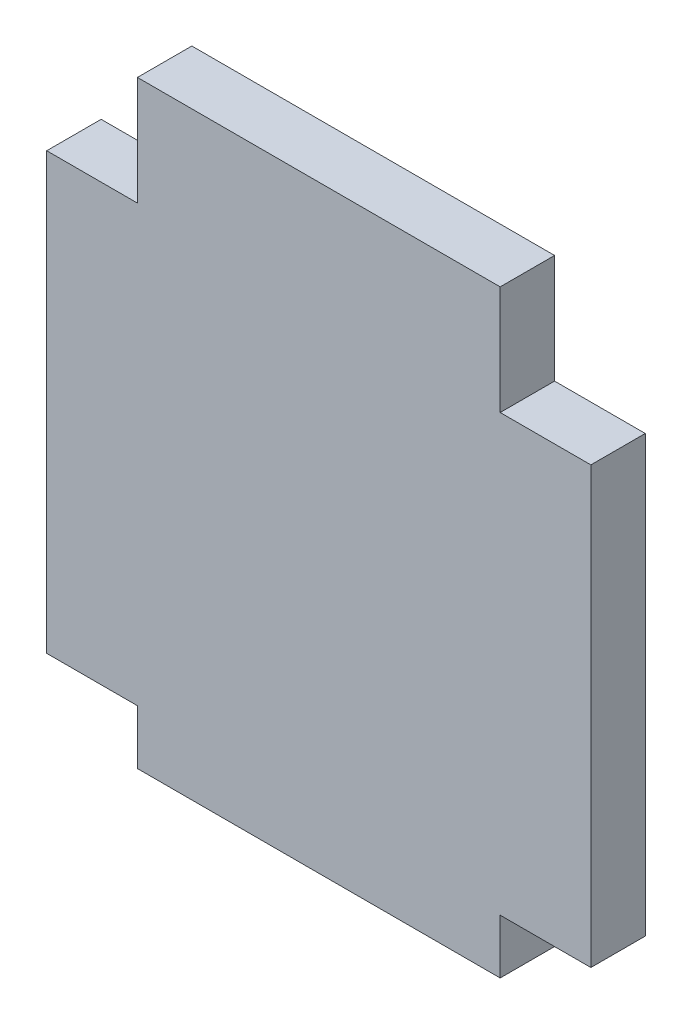
ISO-10303-21;
HEADER;
FILE_DESCRIPTION(('STEP AP214'),'2;1');
FILE_NAME('part.step','',(''),(''),'','','');
FILE_SCHEMA(('AUTOMOTIVE_DESIGN { 1 0 10303 214 1 1 1 1 }'));
ENDSEC;
DATA;
#1=APPLICATION_CONTEXT('core data for automotive mechanical design processes');
#2=APPLICATION_PROTOCOL_DEFINITION('international standard','automotive_design',2000,#1);
#3=PRODUCT_CONTEXT('',#1,'mechanical');
#4=PRODUCT('Part','Part','',(#3));
#5=PRODUCT_RELATED_PRODUCT_CATEGORY('part','',(#4));
#6=PRODUCT_DEFINITION_FORMATION('','',#4);
#7=PRODUCT_DEFINITION_CONTEXT('part definition',#1,'design');
#8=PRODUCT_DEFINITION('design','',#6,#7);
#9=PRODUCT_DEFINITION_SHAPE('','',#8);
#10=(LENGTH_UNIT() NAMED_UNIT(*) SI_UNIT(.MILLI.,.METRE.));
#11=(NAMED_UNIT(*) PLANE_ANGLE_UNIT() SI_UNIT($,.RADIAN.));
#12=(NAMED_UNIT(*) SI_UNIT($,.STERADIAN.) SOLID_ANGLE_UNIT());
#13=UNCERTAINTY_MEASURE_WITH_UNIT(LENGTH_MEASURE(1.E-05),#10,'distance_accuracy_value','');
#14=(GEOMETRIC_REPRESENTATION_CONTEXT(3) GLOBAL_UNCERTAINTY_ASSIGNED_CONTEXT((#13)) GLOBAL_UNIT_ASSIGNED_CONTEXT((#10,
#11,#12)) REPRESENTATION_CONTEXT('',''));
#15=CARTESIAN_POINT('',(0.,0.,0.));
#16=DIRECTION('',(0.,0.,1.));
#17=DIRECTION('',(1.,0.,0.));
#18=AXIS2_PLACEMENT_3D('',#15,#16,#17);
#19=CARTESIAN_POINT('',(0.,-12.,3.));
#20=DIRECTION('',(0.,1.,0.));
#21=DIRECTION('',(0.,0.,1.));
#22=AXIS2_PLACEMENT_3D('',#19,#20,#21);
#23=PLANE('',#22);
#24=DIRECTION('',(1.,0.,0.));
#25=VECTOR('',#24,1.);
#26=CARTESIAN_POINT('',(0.,-12.,0.));
#27=LINE('',#26,#25);
#28=CARTESIAN_POINT('',(-15.,-12.,0.));
#29=VERTEX_POINT('',#28);
#30=CARTESIAN_POINT('',(-10.,-12.,0.));
#31=VERTEX_POINT('',#30);
#32=EDGE_CURVE('E185',#29,#31,#27,.T.);
#33=ORIENTED_EDGE('',*,*,#32,.T.);
#34=DIRECTION('',(0.,0.,-1.));
#35=VECTOR('',#34,1.);
#36=CARTESIAN_POINT('',(-10.,-12.,3.));
#37=LINE('',#36,#35);
#38=CARTESIAN_POINT('',(-10.,-12.,3.));
#39=VERTEX_POINT('',#38);
#40=EDGE_CURVE('E12',#39,#31,#37,.T.);
#41=ORIENTED_EDGE('',*,*,#40,.F.);
#42=DIRECTION('',(1.,0.,0.));
#43=VECTOR('',#42,1.);
#44=CARTESIAN_POINT('',(0.,-12.,3.));
#45=LINE('',#44,#43);
#46=CARTESIAN_POINT('',(-15.,-12.,3.));
#47=VERTEX_POINT('',#46);
#48=EDGE_CURVE('E101',#47,#39,#45,.T.);
#49=ORIENTED_EDGE('',*,*,#48,.F.);
#50=DIRECTION('',(0.,0.,-1.));
#51=VECTOR('',#50,1.);
#52=CARTESIAN_POINT('',(-15.,-12.,3.));
#53=LINE('',#52,#51);
#54=EDGE_CURVE('E52',#47,#29,#53,.T.);
#55=ORIENTED_EDGE('',*,*,#54,.T.);
#56=EDGE_LOOP('',(#33,#41,#49,#55));
#57=FACE_BOUND('',#56,.T.);
#58=ADVANCED_FACE('F35',(#57),#23,.F.);
#59=CARTESIAN_POINT('',(-10.,0.,3.));
#60=DIRECTION('',(-1.,0.,0.));
#61=DIRECTION('',(0.,-1.,0.));
#62=AXIS2_PLACEMENT_3D('',#59,#60,#61);
#63=PLANE('',#62);
#64=DIRECTION('',(0.,1.,0.));
#65=VECTOR('',#64,1.);
#66=CARTESIAN_POINT('',(-10.,0.,0.));
#67=LINE('',#66,#65);
#68=CARTESIAN_POINT('',(-10.,-15.,0.));
#69=VERTEX_POINT('',#68);
#70=EDGE_CURVE('E187',#69,#31,#67,.T.);
#71=ORIENTED_EDGE('',*,*,#70,.F.);
#72=DIRECTION('',(0.,0.,-1.));
#73=VECTOR('',#72,1.);
#74=CARTESIAN_POINT('',(-10.,-15.,3.));
#75=LINE('',#74,#73);
#76=CARTESIAN_POINT('',(-10.,-15.,3.));
#77=VERTEX_POINT('',#76);
#78=EDGE_CURVE('E44',#77,#69,#75,.T.);
#79=ORIENTED_EDGE('',*,*,#78,.F.);
#80=DIRECTION('',(0.,1.,0.));
#81=VECTOR('',#80,1.);
#82=CARTESIAN_POINT('',(-10.,0.,3.));
#83=LINE('',#82,#81);
#84=EDGE_CURVE('E250',#77,#39,#83,.T.);
#85=ORIENTED_EDGE('',*,*,#84,.T.);
#86=ORIENTED_EDGE('',*,*,#40,.T.);
#87=EDGE_LOOP('',(#71,#79,#85,#86));
#88=FACE_BOUND('',#87,.T.);
#89=ADVANCED_FACE('F37',(#88),#63,.T.);
#90=CARTESIAN_POINT('',(0.,-15.,3.));
#91=DIRECTION('',(0.,-1.,0.));
#92=DIRECTION('',(1.,0.,0.));
#93=AXIS2_PLACEMENT_3D('',#90,#91,#92);
#94=PLANE('',#93);
#95=DIRECTION('',(-1.,0.,0.));
#96=VECTOR('',#95,1.);
#97=CARTESIAN_POINT('',(0.,-15.,0.));
#98=LINE('',#97,#96);
#99=CARTESIAN_POINT('',(9.99999999999999,-15.,0.));
#100=VERTEX_POINT('',#99);
#101=EDGE_CURVE('E191',#100,#69,#98,.T.);
#102=ORIENTED_EDGE('',*,*,#101,.F.);
#103=DIRECTION('',(0.,0.,-1.));
#104=VECTOR('',#103,1.);
#105=CARTESIAN_POINT('',(9.99999999999999,-15.,3.));
#106=LINE('',#105,#104);
#107=CARTESIAN_POINT('',(9.99999999999999,-15.,3.));
#108=VERTEX_POINT('',#107);
#109=EDGE_CURVE('E227',#108,#100,#106,.T.);
#110=ORIENTED_EDGE('',*,*,#109,.F.);
#111=DIRECTION('',(-1.,0.,0.));
#112=VECTOR('',#111,1.);
#113=CARTESIAN_POINT('',(0.,-15.,3.));
#114=LINE('',#113,#112);
#115=EDGE_CURVE('E234',#108,#77,#114,.T.);
#116=ORIENTED_EDGE('',*,*,#115,.T.);
#117=ORIENTED_EDGE('',*,*,#78,.T.);
#118=EDGE_LOOP('',(#102,#110,#116,#117));
#119=FACE_BOUND('',#118,.T.);
#120=ADVANCED_FACE('F232',(#119),#94,.T.);
#121=CARTESIAN_POINT('',(9.99999999999998,0.,3.));
#122=DIRECTION('',(-1.,0.,0.));
#123=DIRECTION('',(0.,-1.,0.));
#124=AXIS2_PLACEMENT_3D('',#121,#122,#123);
#125=PLANE('',#124);
#126=DIRECTION('',(0.,1.,0.));
#127=VECTOR('',#126,1.);
#128=CARTESIAN_POINT('',(9.99999999999998,0.,0.));
#129=LINE('',#128,#127);
#130=CARTESIAN_POINT('',(9.99999999999999,-12.,0.));
#131=VERTEX_POINT('',#130);
#132=EDGE_CURVE('E194',#100,#131,#129,.T.);
#133=ORIENTED_EDGE('',*,*,#132,.T.);
#134=DIRECTION('',(0.,0.,-1.));
#135=VECTOR('',#134,1.);
#136=CARTESIAN_POINT('',(9.99999999999999,-12.,3.));
#137=LINE('',#136,#135);
#138=CARTESIAN_POINT('',(9.99999999999999,-12.,3.));
#139=VERTEX_POINT('',#138);
#140=EDGE_CURVE('E224',#139,#131,#137,.T.);
#141=ORIENTED_EDGE('',*,*,#140,.F.);
#142=DIRECTION('',(0.,1.,0.));
#143=VECTOR('',#142,1.);
#144=CARTESIAN_POINT('',(9.99999999999998,0.,3.));
#145=LINE('',#144,#143);
#146=EDGE_CURVE('E166',#108,#139,#145,.T.);
#147=ORIENTED_EDGE('',*,*,#146,.F.);
#148=ORIENTED_EDGE('',*,*,#109,.T.);
#149=EDGE_LOOP('',(#133,#141,#147,#148));
#150=FACE_BOUND('',#149,.T.);
#151=ADVANCED_FACE('F244',(#150),#125,.F.);
#152=CARTESIAN_POINT('',(15.,-12.,0.));
#153=VERTEX_POINT('',#152);
#154=EDGE_CURVE('E188',#131,#153,#27,.T.);
#155=ORIENTED_EDGE('',*,*,#154,.T.);
#156=DIRECTION('',(0.,0.,-1.));
#157=VECTOR('',#156,1.);
#158=CARTESIAN_POINT('',(15.,-12.,3.));
#159=LINE('',#158,#157);
#160=CARTESIAN_POINT('',(15.,-12.,3.));
#161=VERTEX_POINT('',#160);
#162=EDGE_CURVE('E221',#161,#153,#159,.T.);
#163=ORIENTED_EDGE('',*,*,#162,.F.);
#164=EDGE_CURVE('E163',#139,#161,#45,.T.);
#165=ORIENTED_EDGE('',*,*,#164,.F.);
#166=ORIENTED_EDGE('',*,*,#140,.T.);
#167=EDGE_LOOP('',(#155,#163,#165,#166));
#168=FACE_BOUND('',#167,.T.);
#169=ADVANCED_FACE('F248',(#168),#23,.F.);
#170=CARTESIAN_POINT('',(15.,0.,3.));
#171=DIRECTION('',(-1.,0.,0.));
#172=DIRECTION('',(0.,0.,1.));
#173=AXIS2_PLACEMENT_3D('',#170,#171,#172);
#174=PLANE('',#173);
#175=DIRECTION('',(0.,1.,0.));
#176=VECTOR('',#175,1.);
#177=CARTESIAN_POINT('',(15.,0.,0.));
#178=LINE('',#177,#176);
#179=CARTESIAN_POINT('',(15.,12.,0.));
#180=VERTEX_POINT('',#179);
#181=EDGE_CURVE('E196',#153,#180,#178,.T.);
#182=ORIENTED_EDGE('',*,*,#181,.T.);
#183=DIRECTION('',(0.,0.,-1.));
#184=VECTOR('',#183,1.);
#185=CARTESIAN_POINT('',(15.,12.,3.));
#186=LINE('',#185,#184);
#187=CARTESIAN_POINT('',(15.,12.,3.));
#188=VERTEX_POINT('',#187);
#189=EDGE_CURVE('E219',#188,#180,#186,.T.);
#190=ORIENTED_EDGE('',*,*,#189,.F.);
#191=DIRECTION('',(0.,1.,0.));
#192=VECTOR('',#191,1.);
#193=CARTESIAN_POINT('',(15.,0.,3.));
#194=LINE('',#193,#192);
#195=EDGE_CURVE('E159',#161,#188,#194,.T.);
#196=ORIENTED_EDGE('',*,*,#195,.F.);
#197=ORIENTED_EDGE('',*,*,#162,.T.);
#198=EDGE_LOOP('',(#182,#190,#196,#197));
#199=FACE_BOUND('',#198,.T.);
#200=ADVANCED_FACE('F260',(#199),#174,.F.);
#201=CARTESIAN_POINT('',(0.,12.,3.));
#202=DIRECTION('',(0.,1.,0.));
#203=DIRECTION('',(0.,0.,1.));
#204=AXIS2_PLACEMENT_3D('',#201,#202,#203);
#205=PLANE('',#204);
#206=DIRECTION('',(1.,0.,0.));
#207=VECTOR('',#206,1.);
#208=CARTESIAN_POINT('',(0.,12.,0.));
#209=LINE('',#208,#207);
#210=CARTESIAN_POINT('',(9.99999999999999,12.,0.));
#211=VERTEX_POINT('',#210);
#212=EDGE_CURVE('E199',#211,#180,#209,.T.);
#213=ORIENTED_EDGE('',*,*,#212,.F.);
#214=DIRECTION('',(0.,0.,-1.));
#215=VECTOR('',#214,1.);
#216=CARTESIAN_POINT('',(9.99999999999999,12.,3.));
#217=LINE('',#216,#215);
#218=CARTESIAN_POINT('',(9.99999999999999,12.,3.));
#219=VERTEX_POINT('',#218);
#220=EDGE_CURVE('E217',#219,#211,#217,.T.);
#221=ORIENTED_EDGE('',*,*,#220,.F.);
#222=DIRECTION('',(1.,0.,0.));
#223=VECTOR('',#222,1.);
#224=CARTESIAN_POINT('',(0.,12.,3.));
#225=LINE('',#224,#223);
#226=EDGE_CURVE('E153',#219,#188,#225,.T.);
#227=ORIENTED_EDGE('',*,*,#226,.T.);
#228=ORIENTED_EDGE('',*,*,#189,.T.);
#229=EDGE_LOOP('',(#213,#221,#227,#228));
#230=FACE_BOUND('',#229,.T.);
#231=ADVANCED_FACE('F262',(#230),#205,.T.);
#232=CARTESIAN_POINT('',(9.99999999999999,0.,3.));
#233=DIRECTION('',(1.,0.,0.));
#234=DIRECTION('',(0.,1.,0.));
#235=AXIS2_PLACEMENT_3D('',#232,#233,#234);
#236=PLANE('',#235);
#237=DIRECTION('',(0.,-1.,0.));
#238=VECTOR('',#237,1.);
#239=CARTESIAN_POINT('',(9.99999999999999,0.,0.));
#240=LINE('',#239,#238);
#241=CARTESIAN_POINT('',(9.99999999999999,18.,0.));
#242=VERTEX_POINT('',#241);
#243=EDGE_CURVE('E202',#242,#211,#240,.T.);
#244=ORIENTED_EDGE('',*,*,#243,.F.);
#245=DIRECTION('',(0.,0.,-1.));
#246=VECTOR('',#245,1.);
#247=CARTESIAN_POINT('',(9.99999999999999,18.,3.));
#248=LINE('',#247,#246);
#249=CARTESIAN_POINT('',(9.99999999999999,18.,3.));
#250=VERTEX_POINT('',#249);
#251=EDGE_CURVE('E215',#250,#242,#248,.T.);
#252=ORIENTED_EDGE('',*,*,#251,.F.);
#253=DIRECTION('',(0.,-1.,0.));
#254=VECTOR('',#253,1.);
#255=CARTESIAN_POINT('',(9.99999999999999,0.,3.));
#256=LINE('',#255,#254);
#257=EDGE_CURVE('E158',#250,#219,#256,.T.);
#258=ORIENTED_EDGE('',*,*,#257,.T.);
#259=ORIENTED_EDGE('',*,*,#220,.T.);
#260=EDGE_LOOP('',(#244,#252,#258,#259));
#261=FACE_BOUND('',#260,.T.);
#262=ADVANCED_FACE('F266',(#261),#236,.T.);
#263=CARTESIAN_POINT('',(0.,18.,3.));
#264=DIRECTION('',(0.,-1.,0.));
#265=DIRECTION('',(1.,0.,0.));
#266=AXIS2_PLACEMENT_3D('',#263,#264,#265);
#267=PLANE('',#266);
#268=DIRECTION('',(-1.,0.,0.));
#269=VECTOR('',#268,1.);
#270=CARTESIAN_POINT('',(0.,18.,0.));
#271=LINE('',#270,#269);
#272=CARTESIAN_POINT('',(-10.,18.,0.));
#273=VERTEX_POINT('',#272);
#274=EDGE_CURVE('E206',#242,#273,#271,.T.);
#275=ORIENTED_EDGE('',*,*,#274,.T.);
#276=DIRECTION('',(0.,0.,-1.));
#277=VECTOR('',#276,1.);
#278=CARTESIAN_POINT('',(-10.,18.,3.));
#279=LINE('',#278,#277);
#280=CARTESIAN_POINT('',(-10.,18.,3.));
#281=VERTEX_POINT('',#280);
#282=EDGE_CURVE('E148',#281,#273,#279,.T.);
#283=ORIENTED_EDGE('',*,*,#282,.F.);
#284=DIRECTION('',(-1.,0.,0.));
#285=VECTOR('',#284,1.);
#286=CARTESIAN_POINT('',(0.,18.,3.));
#287=LINE('',#286,#285);
#288=EDGE_CURVE('E136',#250,#281,#287,.T.);
#289=ORIENTED_EDGE('',*,*,#288,.F.);
#290=ORIENTED_EDGE('',*,*,#251,.T.);
#291=EDGE_LOOP('',(#275,#283,#289,#290));
#292=FACE_BOUND('',#291,.T.);
#293=ADVANCED_FACE('F268',(#292),#267,.F.);
#294=CARTESIAN_POINT('',(-10.,0.,3.));
#295=DIRECTION('',(1.,0.,0.));
#296=DIRECTION('',(0.,1.,0.));
#297=AXIS2_PLACEMENT_3D('',#294,#295,#296);
#298=PLANE('',#297);
#299=DIRECTION('',(0.,-1.,0.));
#300=VECTOR('',#299,1.);
#301=CARTESIAN_POINT('',(-10.,0.,0.));
#302=LINE('',#301,#300);
#303=CARTESIAN_POINT('',(-10.,12.,0.));
#304=VERTEX_POINT('',#303);
#305=EDGE_CURVE('E145',#273,#304,#302,.T.);
#306=ORIENTED_EDGE('',*,*,#305,.T.);
#307=DIRECTION('',(0.,0.,-1.));
#308=VECTOR('',#307,1.);
#309=CARTESIAN_POINT('',(-10.,12.,3.));
#310=LINE('',#309,#308);
#311=CARTESIAN_POINT('',(-10.,12.,3.));
#312=VERTEX_POINT('',#311);
#313=EDGE_CURVE('E142',#312,#304,#310,.T.);
#314=ORIENTED_EDGE('',*,*,#313,.F.);
#315=DIRECTION('',(0.,-1.,0.));
#316=VECTOR('',#315,1.);
#317=CARTESIAN_POINT('',(-10.,0.,3.));
#318=LINE('',#317,#316);
#319=EDGE_CURVE('E129',#281,#312,#318,.T.);
#320=ORIENTED_EDGE('',*,*,#319,.F.);
#321=ORIENTED_EDGE('',*,*,#282,.T.);
#322=EDGE_LOOP('',(#306,#314,#320,#321));
#323=FACE_BOUND('',#322,.T.);
#324=ADVANCED_FACE('F143',(#323),#298,.F.);
#325=CARTESIAN_POINT('',(-15.,12.,0.));
#326=VERTEX_POINT('',#325);
#327=EDGE_CURVE('E203',#326,#304,#209,.T.);
#328=ORIENTED_EDGE('',*,*,#327,.F.);
#329=DIRECTION('',(0.,0.,-1.));
#330=VECTOR('',#329,1.);
#331=CARTESIAN_POINT('',(-15.,12.,3.));
#332=LINE('',#331,#330);
#333=CARTESIAN_POINT('',(-15.,12.,3.));
#334=VERTEX_POINT('',#333);
#335=EDGE_CURVE('E89',#334,#326,#332,.T.);
#336=ORIENTED_EDGE('',*,*,#335,.F.);
#337=EDGE_CURVE('E133',#334,#312,#225,.T.);
#338=ORIENTED_EDGE('',*,*,#337,.T.);
#339=ORIENTED_EDGE('',*,*,#313,.T.);
#340=EDGE_LOOP('',(#328,#336,#338,#339));
#341=FACE_BOUND('',#340,.T.);
#342=ADVANCED_FACE('F150',(#341),#205,.T.);
#343=CARTESIAN_POINT('',(-15.,0.,3.));
#344=DIRECTION('',(-1.,0.,0.));
#345=DIRECTION('',(0.,0.,1.));
#346=AXIS2_PLACEMENT_3D('',#343,#344,#345);
#347=PLANE('',#346);
#348=DIRECTION('',(0.,1.,0.));
#349=VECTOR('',#348,1.);
#350=CARTESIAN_POINT('',(-15.,0.,0.));
#351=LINE('',#350,#349);
#352=EDGE_CURVE('E209',#29,#326,#351,.T.);
#353=ORIENTED_EDGE('',*,*,#352,.F.);
#354=ORIENTED_EDGE('',*,*,#54,.F.);
#355=DIRECTION('',(0.,1.,0.));
#356=VECTOR('',#355,1.);
#357=CARTESIAN_POINT('',(-15.,0.,3.));
#358=LINE('',#357,#356);
#359=EDGE_CURVE('E151',#47,#334,#358,.T.);
#360=ORIENTED_EDGE('',*,*,#359,.T.);
#361=ORIENTED_EDGE('',*,*,#335,.T.);
#362=EDGE_LOOP('',(#353,#354,#360,#361));
#363=FACE_BOUND('',#362,.T.);
#364=ADVANCED_FACE('F269',(#363),#347,.T.);
#365=CARTESIAN_POINT('',(0.,0.,3.));
#366=DIRECTION('',(0.,0.,1.));
#367=DIRECTION('',(1.,0.,0.));
#368=AXIS2_PLACEMENT_3D('',#365,#366,#367);
#369=PLANE('',#368);
#370=ORIENTED_EDGE('',*,*,#48,.T.);
#371=ORIENTED_EDGE('',*,*,#84,.F.);
#372=ORIENTED_EDGE('',*,*,#115,.F.);
#373=ORIENTED_EDGE('',*,*,#146,.T.);
#374=ORIENTED_EDGE('',*,*,#164,.T.);
#375=ORIENTED_EDGE('',*,*,#195,.T.);
#376=ORIENTED_EDGE('',*,*,#226,.F.);
#377=ORIENTED_EDGE('',*,*,#257,.F.);
#378=ORIENTED_EDGE('',*,*,#288,.T.);
#379=ORIENTED_EDGE('',*,*,#319,.T.);
#380=ORIENTED_EDGE('',*,*,#337,.F.);
#381=ORIENTED_EDGE('',*,*,#359,.F.);
#382=EDGE_LOOP('',(#370,#371,#372,#373,#374,#375,#376,#377,#378,#379,#380,#381));
#383=FACE_BOUND('',#382,.T.);
#384=ADVANCED_FACE('F131',(#383),#369,.T.);
#385=CARTESIAN_POINT('',(0.,0.,0.));
#386=DIRECTION('',(0.,0.,1.));
#387=DIRECTION('',(1.,0.,0.));
#388=AXIS2_PLACEMENT_3D('',#385,#386,#387);
#389=PLANE('',#388);
#390=ORIENTED_EDGE('',*,*,#32,.F.);
#391=ORIENTED_EDGE('',*,*,#352,.T.);
#392=ORIENTED_EDGE('',*,*,#327,.T.);
#393=ORIENTED_EDGE('',*,*,#305,.F.);
#394=ORIENTED_EDGE('',*,*,#274,.F.);
#395=ORIENTED_EDGE('',*,*,#243,.T.);
#396=ORIENTED_EDGE('',*,*,#212,.T.);
#397=ORIENTED_EDGE('',*,*,#181,.F.);
#398=ORIENTED_EDGE('',*,*,#154,.F.);
#399=ORIENTED_EDGE('',*,*,#132,.F.);
#400=ORIENTED_EDGE('',*,*,#101,.T.);
#401=ORIENTED_EDGE('',*,*,#70,.T.);
#402=EDGE_LOOP('',(#390,#391,#392,#393,#394,#395,#396,#397,#398,#399,#400,#401));
#403=FACE_BOUND('',#402,.T.);
#404=ADVANCED_FACE('F239',(#403),#389,.F.);
#405=CLOSED_SHELL('',(#58,#89,#120,#151,#169,#200,#231,#262,#293,#324,#342,#364,#384,#404));
#406=MANIFOLD_SOLID_BREP('B2',#405);
#407=ADVANCED_BREP_SHAPE_REPRESENTATION('',(#18,#406),#14);
#408=SHAPE_DEFINITION_REPRESENTATION(#9,#407);
ENDSEC;
END-ISO-10303-21;
